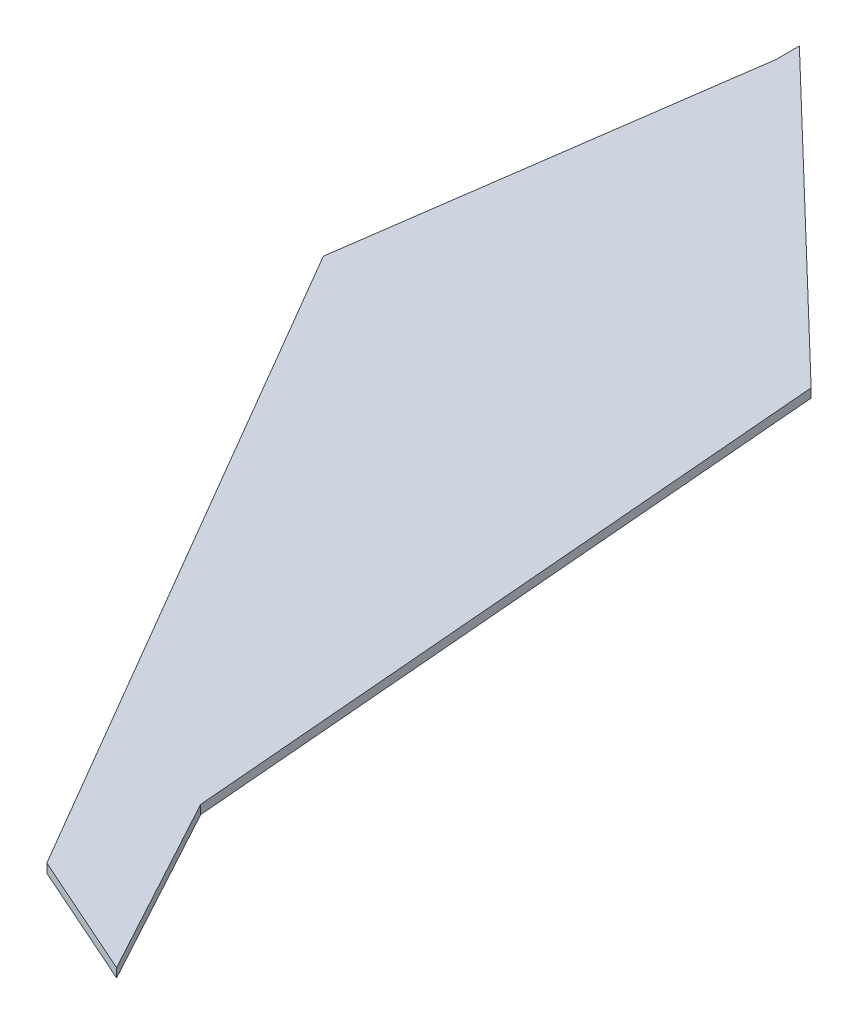
ISO-10303-21;
HEADER;
FILE_DESCRIPTION(('STEP AP214'),'2;1');
FILE_NAME('part.step','',(''),(''),'','','');
FILE_SCHEMA(('AUTOMOTIVE_DESIGN { 1 0 10303 214 1 1 1 1 }'));
ENDSEC;
DATA;
#1=APPLICATION_CONTEXT('core data for automotive mechanical design processes');
#2=APPLICATION_PROTOCOL_DEFINITION('international standard','automotive_design',2000,#1);
#3=PRODUCT_CONTEXT('',#1,'mechanical');
#4=PRODUCT('Part','Part','',(#3));
#5=PRODUCT_RELATED_PRODUCT_CATEGORY('part','',(#4));
#6=PRODUCT_DEFINITION_FORMATION('','',#4);
#7=PRODUCT_DEFINITION_CONTEXT('part definition',#1,'design');
#8=PRODUCT_DEFINITION('design','',#6,#7);
#9=PRODUCT_DEFINITION_SHAPE('','',#8);
#10=(LENGTH_UNIT() NAMED_UNIT(*) SI_UNIT(.MILLI.,.METRE.));
#11=(NAMED_UNIT(*) PLANE_ANGLE_UNIT() SI_UNIT($,.RADIAN.));
#12=(NAMED_UNIT(*) SI_UNIT($,.STERADIAN.) SOLID_ANGLE_UNIT());
#13=UNCERTAINTY_MEASURE_WITH_UNIT(LENGTH_MEASURE(1.E-05),#10,'distance_accuracy_value','');
#14=(GEOMETRIC_REPRESENTATION_CONTEXT(3) GLOBAL_UNCERTAINTY_ASSIGNED_CONTEXT((#13)) GLOBAL_UNIT_ASSIGNED_CONTEXT((#10,
#11,#12)) REPRESENTATION_CONTEXT('',''));
#15=CARTESIAN_POINT('',(0.,0.,0.));
#16=DIRECTION('',(0.,0.,1.));
#17=DIRECTION('',(1.,0.,0.));
#18=AXIS2_PLACEMENT_3D('',#15,#16,#17);
#19=CARTESIAN_POINT('',(5.87713478696692,2.,-28.6445030458678));
#20=DIRECTION('',(-0.996543331908202,0.,0.0830745907561315));
#21=DIRECTION('',(0.0830745907561315,0.,0.996543331908202));
#22=AXIS2_PLACEMENT_3D('',#19,#20,#21);
#23=PLANE('',#22);
#24=DIRECTION('',(-0.0830745907561315,0.,-0.996543331908202));
#25=VECTOR('',#24,1.);
#26=CARTESIAN_POINT('',(5.87713478696692,0.,-28.6445030458678));
#27=LINE('',#26,#25);
#28=CARTESIAN_POINT('',(5.87713478696692,0.,-28.6445030458678));
#29=VERTEX_POINT('',#28);
#30=CARTESIAN_POINT('',(-6.58540462222794,0.,-178.142206661816));
#31=VERTEX_POINT('',#30);
#32=EDGE_CURVE('E134',#29,#31,#27,.T.);
#33=ORIENTED_EDGE('',*,*,#32,.T.);
#34=DIRECTION('',(0.,-1.,0.));
#35=VECTOR('',#34,1.);
#36=CARTESIAN_POINT('',(-6.58540462222794,2.,-178.142206661816));
#37=LINE('',#36,#35);
#38=CARTESIAN_POINT('',(-6.58540462222794,2.,-178.142206661816));
#39=VERTEX_POINT('',#38);
#40=EDGE_CURVE('E11',#39,#31,#37,.T.);
#41=ORIENTED_EDGE('',*,*,#40,.F.);
#42=DIRECTION('',(-0.0830745907561315,0.,-0.996543331908202));
#43=VECTOR('',#42,1.);
#44=CARTESIAN_POINT('',(5.87713478696692,2.,-28.6445030458678));
#45=LINE('',#44,#43);
#46=CARTESIAN_POINT('',(5.87713478696692,2.,-28.6445030458678));
#47=VERTEX_POINT('',#46);
#48=EDGE_CURVE('E153',#47,#39,#45,.T.);
#49=ORIENTED_EDGE('',*,*,#48,.F.);
#50=DIRECTION('',(0.,-1.,0.));
#51=VECTOR('',#50,1.);
#52=CARTESIAN_POINT('',(5.87713478696692,2.,-28.6445030458678));
#53=LINE('',#52,#51);
#54=EDGE_CURVE('E130',#47,#29,#53,.T.);
#55=ORIENTED_EDGE('',*,*,#54,.T.);
#56=EDGE_LOOP('',(#33,#41,#49,#55));
#57=FACE_BOUND('',#56,.T.);
#58=ADVANCED_FACE('F39',(#57),#23,.F.);
#59=CARTESIAN_POINT('',(-6.58540462222794,2.,-178.142206661816));
#60=DIRECTION('',(-0.692931661043767,0.,0.721003268455231));
#61=DIRECTION('',(0.721003268455231,0.,0.692931661043767));
#62=AXIS2_PLACEMENT_3D('',#59,#60,#61);
#63=PLANE('',#62);
#64=DIRECTION('',(-0.721003268455231,0.,-0.692931661043767));
#65=VECTOR('',#64,1.);
#66=CARTESIAN_POINT('',(-6.58540462222794,0.,-178.142206661816));
#67=LINE('',#66,#65);
#68=CARTESIAN_POINT('',(-74.3565474485001,0.,-243.274741594782));
#69=VERTEX_POINT('',#68);
#70=EDGE_CURVE('E138',#31,#69,#67,.T.);
#71=ORIENTED_EDGE('',*,*,#70,.T.);
#72=DIRECTION('',(0.,-1.,0.));
#73=VECTOR('',#72,1.);
#74=CARTESIAN_POINT('',(-74.3565474485001,2.,-243.274741594782));
#75=LINE('',#74,#73);
#76=CARTESIAN_POINT('',(-74.3565474485001,2.,-243.274741594782));
#77=VERTEX_POINT('',#76);
#78=EDGE_CURVE('E48',#77,#69,#75,.T.);
#79=ORIENTED_EDGE('',*,*,#78,.F.);
#80=DIRECTION('',(-0.721003268455231,0.,-0.692931661043767));
#81=VECTOR('',#80,1.);
#82=CARTESIAN_POINT('',(-6.58540462222794,2.,-178.142206661816));
#83=LINE('',#82,#81);
#84=EDGE_CURVE('E96',#39,#77,#83,.T.);
#85=ORIENTED_EDGE('',*,*,#84,.F.);
#86=ORIENTED_EDGE('',*,*,#40,.T.);
#87=EDGE_LOOP('',(#71,#79,#85,#86));
#88=FACE_BOUND('',#87,.T.);
#89=ADVANCED_FACE('F187',(#88),#63,.F.);
#90=CARTESIAN_POINT('',(-74.3565474485001,2.,-243.274741594782));
#91=DIRECTION('',(1.,0.,0.));
#92=DIRECTION('',(0.,0.,-1.));
#93=AXIS2_PLACEMENT_3D('',#90,#91,#92);
#94=PLANE('',#93);
#95=DIRECTION('',(0.,0.,1.));
#96=VECTOR('',#95,1.);
#97=CARTESIAN_POINT('',(-74.3565474485001,0.,-243.274741594782));
#98=LINE('',#97,#96);
#99=CARTESIAN_POINT('',(-74.3565474485001,0.,-237.978779522608));
#100=VERTEX_POINT('',#99);
#101=EDGE_CURVE('E141',#69,#100,#98,.T.);
#102=ORIENTED_EDGE('',*,*,#101,.T.);
#103=DIRECTION('',(0.,-1.,0.));
#104=VECTOR('',#103,1.);
#105=CARTESIAN_POINT('',(-74.3565474485001,2.,-237.978779522608));
#106=LINE('',#105,#104);
#107=CARTESIAN_POINT('',(-74.3565474485001,2.,-237.978779522608));
#108=VERTEX_POINT('',#107);
#109=EDGE_CURVE('E160',#108,#100,#106,.T.);
#110=ORIENTED_EDGE('',*,*,#109,.F.);
#111=DIRECTION('',(0.,0.,1.));
#112=VECTOR('',#111,1.);
#113=CARTESIAN_POINT('',(-74.3565474485001,2.,-243.274741594782));
#114=LINE('',#113,#112);
#115=EDGE_CURVE('E170',#77,#108,#114,.T.);
#116=ORIENTED_EDGE('',*,*,#115,.F.);
#117=ORIENTED_EDGE('',*,*,#78,.T.);
#118=EDGE_LOOP('',(#102,#110,#116,#117));
#119=FACE_BOUND('',#118,.T.);
#120=ADVANCED_FACE('F168',(#119),#94,.F.);
#121=CARTESIAN_POINT('',(-74.3565474485001,2.,-237.978779522608));
#122=DIRECTION('',(0.990174805090719,0.,0.139835100613388));
#123=DIRECTION('',(0.139835100613388,0.,-0.990174805090719));
#124=AXIS2_PLACEMENT_3D('',#121,#122,#123);
#125=PLANE('',#124);
#126=DIRECTION('',(-0.139835100613388,0.,0.990174805090719));
#127=VECTOR('',#126,1.);
#128=CARTESIAN_POINT('',(-74.3565474485001,0.,-237.978779522608));
#129=LINE('',#128,#127);
#130=CARTESIAN_POINT('',(-86.9238512426127,0.,-148.98948048205));
#131=VERTEX_POINT('',#130);
#132=EDGE_CURVE('E144',#100,#131,#129,.T.);
#133=ORIENTED_EDGE('',*,*,#132,.T.);
#134=DIRECTION('',(0.,-1.,0.));
#135=VECTOR('',#134,1.);
#136=CARTESIAN_POINT('',(-86.9238512426127,2.,-148.98948048205));
#137=LINE('',#136,#135);
#138=CARTESIAN_POINT('',(-86.9238512426127,2.,-148.98948048205));
#139=VERTEX_POINT('',#138);
#140=EDGE_CURVE('E123',#139,#131,#137,.T.);
#141=ORIENTED_EDGE('',*,*,#140,.F.);
#142=DIRECTION('',(-0.139835100613388,0.,0.990174805090719));
#143=VECTOR('',#142,1.);
#144=CARTESIAN_POINT('',(-74.3565474485001,2.,-237.978779522608));
#145=LINE('',#144,#143);
#146=EDGE_CURVE('E112',#108,#139,#145,.T.);
#147=ORIENTED_EDGE('',*,*,#146,.F.);
#148=ORIENTED_EDGE('',*,*,#109,.T.);
#149=EDGE_LOOP('',(#133,#141,#147,#148));
#150=FACE_BOUND('',#149,.T.);
#151=ADVANCED_FACE('F176',(#150),#125,.F.);
#152=CARTESIAN_POINT('',(-86.9238512426127,2.,-148.98948048205));
#153=DIRECTION('',(0.863745287496893,0.,-0.503928644082582));
#154=DIRECTION('',(-0.503928644082582,0.,-0.863745287496893));
#155=AXIS2_PLACEMENT_3D('',#152,#153,#154);
#156=PLANE('',#155);
#157=DIRECTION('',(0.503928644082582,0.,0.863745287496893));
#158=VECTOR('',#157,1.);
#159=CARTESIAN_POINT('',(-86.9238512426127,0.,-148.98948048205));
#160=LINE('',#159,#158);
#161=CARTESIAN_POINT('',(0.,0.,0.));
#162=VERTEX_POINT('',#161);
#163=EDGE_CURVE('E121',#131,#162,#160,.T.);
#164=ORIENTED_EDGE('',*,*,#163,.T.);
#165=DIRECTION('',(0.,-1.,0.));
#166=VECTOR('',#165,1.);
#167=CARTESIAN_POINT('',(0.,2.,0.));
#168=LINE('',#167,#166);
#169=CARTESIAN_POINT('',(0.,2.,0.));
#170=VERTEX_POINT('',#169);
#171=EDGE_CURVE('E118',#170,#162,#168,.T.);
#172=ORIENTED_EDGE('',*,*,#171,.F.);
#173=DIRECTION('',(0.503928644082582,0.,0.863745287496893));
#174=VECTOR('',#173,1.);
#175=CARTESIAN_POINT('',(-86.9238512426127,2.,-148.98948048205));
#176=LINE('',#175,#174);
#177=EDGE_CURVE('E106',#139,#170,#176,.T.);
#178=ORIENTED_EDGE('',*,*,#177,.F.);
#179=ORIENTED_EDGE('',*,*,#140,.T.);
#180=EDGE_LOOP('',(#164,#172,#178,#179));
#181=FACE_BOUND('',#180,.T.);
#182=ADVANCED_FACE('F119',(#181),#156,.F.);
#183=CARTESIAN_POINT('',(0.,2.,0.));
#184=DIRECTION('',(0.406597877481696,0.,-0.913607227438235));
#185=DIRECTION('',(-0.913607227438235,0.,-0.406597877481696));
#186=AXIS2_PLACEMENT_3D('',#183,#184,#185);
#187=PLANE('',#186);
#188=DIRECTION('',(0.913607227438235,0.,0.406597877481696));
#189=VECTOR('',#188,1.);
#190=CARTESIAN_POINT('',(0.,0.,0.));
#191=LINE('',#190,#189);
#192=CARTESIAN_POINT('',(28.1914701230741,0.,12.5465206172589));
#193=VERTEX_POINT('',#192);
#194=EDGE_CURVE('E82',#162,#193,#191,.T.);
#195=ORIENTED_EDGE('',*,*,#194,.T.);
#196=DIRECTION('',(0.,-1.,0.));
#197=VECTOR('',#196,1.);
#198=CARTESIAN_POINT('',(28.1914701230741,2.,12.5465206172589));
#199=LINE('',#198,#197);
#200=CARTESIAN_POINT('',(28.1914701230741,2.,12.5465206172589));
#201=VERTEX_POINT('',#200);
#202=EDGE_CURVE('E124',#201,#193,#199,.T.);
#203=ORIENTED_EDGE('',*,*,#202,.F.);
#204=DIRECTION('',(0.913607227438235,0.,0.406597877481696));
#205=VECTOR('',#204,1.);
#206=CARTESIAN_POINT('',(0.,2.,0.));
#207=LINE('',#206,#205);
#208=EDGE_CURVE('E110',#170,#201,#207,.T.);
#209=ORIENTED_EDGE('',*,*,#208,.F.);
#210=ORIENTED_EDGE('',*,*,#171,.T.);
#211=EDGE_LOOP('',(#195,#203,#209,#210));
#212=FACE_BOUND('',#211,.T.);
#213=ADVANCED_FACE('F126',(#212),#187,.F.);
#214=CARTESIAN_POINT('',(28.1914701230741,2.,12.5465206172589));
#215=DIRECTION('',(-0.879269340762849,0.,0.476324916831425));
#216=DIRECTION('',(0.476324916831425,0.,0.879269340762849));
#217=AXIS2_PLACEMENT_3D('',#214,#215,#216);
#218=PLANE('',#217);
#219=DIRECTION('',(-0.476324916831425,0.,-0.879269340762849));
#220=VECTOR('',#219,1.);
#221=CARTESIAN_POINT('',(28.1914701230741,0.,12.5465206172589));
#222=LINE('',#221,#220);
#223=EDGE_CURVE('E88',#193,#29,#222,.T.);
#224=ORIENTED_EDGE('',*,*,#223,.T.);
#225=ORIENTED_EDGE('',*,*,#54,.F.);
#226=DIRECTION('',(-0.476324916831425,0.,-0.879269340762849));
#227=VECTOR('',#226,1.);
#228=CARTESIAN_POINT('',(28.1914701230741,2.,12.5465206172589));
#229=LINE('',#228,#227);
#230=EDGE_CURVE('E56',#201,#47,#229,.T.);
#231=ORIENTED_EDGE('',*,*,#230,.F.);
#232=ORIENTED_EDGE('',*,*,#202,.T.);
#233=EDGE_LOOP('',(#224,#225,#231,#232));
#234=FACE_BOUND('',#233,.T.);
#235=ADVANCED_FACE('F201',(#234),#218,.F.);
#236=CARTESIAN_POINT('',(0.,2.,0.));
#237=DIRECTION('',(0.,-1.,0.));
#238=DIRECTION('',(0.,0.,-1.));
#239=AXIS2_PLACEMENT_3D('',#236,#237,#238);
#240=PLANE('',#239);
#241=ORIENTED_EDGE('',*,*,#48,.T.);
#242=ORIENTED_EDGE('',*,*,#84,.T.);
#243=ORIENTED_EDGE('',*,*,#115,.T.);
#244=ORIENTED_EDGE('',*,*,#146,.T.);
#245=ORIENTED_EDGE('',*,*,#177,.T.);
#246=ORIENTED_EDGE('',*,*,#208,.T.);
#247=ORIENTED_EDGE('',*,*,#230,.T.);
#248=EDGE_LOOP('',(#241,#242,#243,#244,#245,#246,#247));
#249=FACE_BOUND('',#248,.T.);
#250=ADVANCED_FACE('F108',(#249),#240,.F.);
#251=CARTESIAN_POINT('',(0.,0.,0.));
#252=DIRECTION('',(0.,-1.,0.));
#253=DIRECTION('',(0.,0.,-1.));
#254=AXIS2_PLACEMENT_3D('',#251,#252,#253);
#255=PLANE('',#254);
#256=ORIENTED_EDGE('',*,*,#32,.F.);
#257=ORIENTED_EDGE('',*,*,#223,.F.);
#258=ORIENTED_EDGE('',*,*,#194,.F.);
#259=ORIENTED_EDGE('',*,*,#163,.F.);
#260=ORIENTED_EDGE('',*,*,#132,.F.);
#261=ORIENTED_EDGE('',*,*,#101,.F.);
#262=ORIENTED_EDGE('',*,*,#70,.F.);
#263=EDGE_LOOP('',(#256,#257,#258,#259,#260,#261,#262));
#264=FACE_BOUND('',#263,.T.);
#265=ADVANCED_FACE('F174',(#264),#255,.T.);
#266=CLOSED_SHELL('',(#58,#89,#120,#151,#182,#213,#235,#250,#265));
#267=MANIFOLD_SOLID_BREP('B2',#266);
#268=ADVANCED_BREP_SHAPE_REPRESENTATION('',(#18,#267),#14);
#269=SHAPE_DEFINITION_REPRESENTATION(#9,#268);
ENDSEC;
END-ISO-10303-21;
